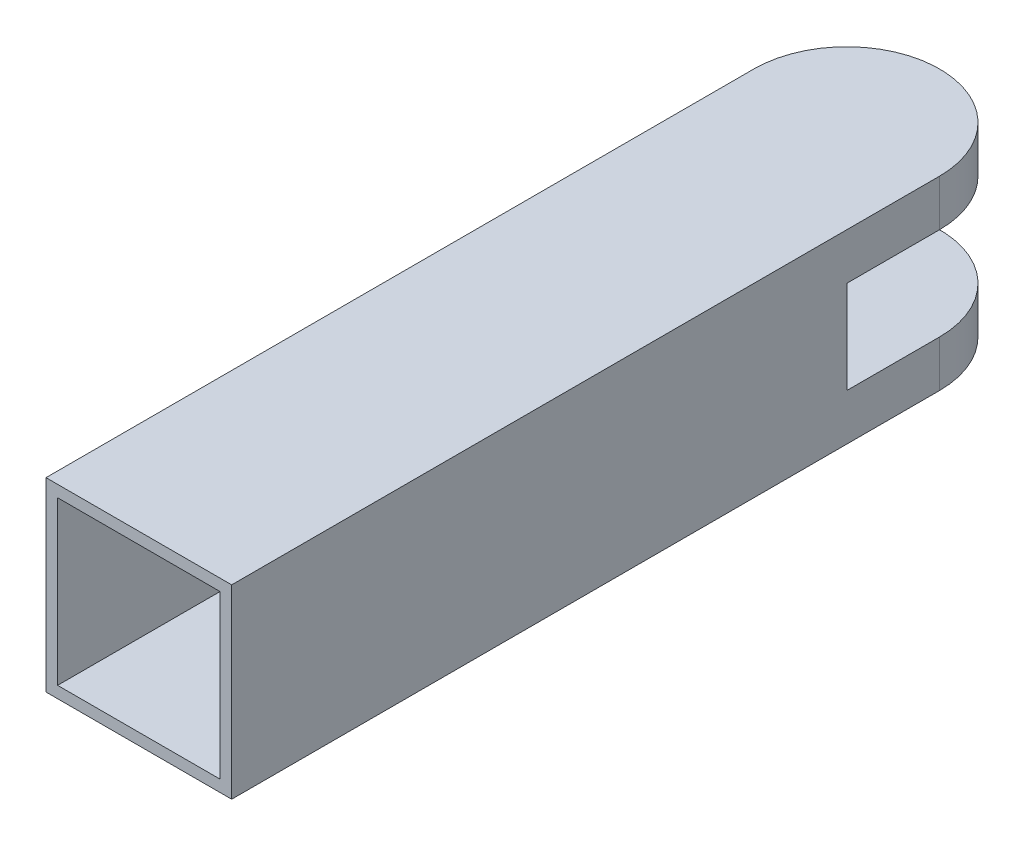
ISO-10303-21;
HEADER;
FILE_DESCRIPTION(('STEP AP214'),'2;1');
FILE_NAME('part.step','',(''),(''),'','','');
FILE_SCHEMA(('AUTOMOTIVE_DESIGN { 1 0 10303 214 1 1 1 1 }'));
ENDSEC;
DATA;
#1=APPLICATION_CONTEXT('core data for automotive mechanical design processes');
#2=APPLICATION_PROTOCOL_DEFINITION('international standard','automotive_design',2000,#1);
#3=PRODUCT_CONTEXT('',#1,'mechanical');
#4=PRODUCT('Part','Part','',(#3));
#5=PRODUCT_RELATED_PRODUCT_CATEGORY('part','',(#4));
#6=PRODUCT_DEFINITION_FORMATION('','',#4);
#7=PRODUCT_DEFINITION_CONTEXT('part definition',#1,'design');
#8=PRODUCT_DEFINITION('design','',#6,#7);
#9=PRODUCT_DEFINITION_SHAPE('','',#8);
#10=(LENGTH_UNIT() NAMED_UNIT(*) SI_UNIT(.MILLI.,.METRE.));
#11=(NAMED_UNIT(*) PLANE_ANGLE_UNIT() SI_UNIT($,.RADIAN.));
#12=(NAMED_UNIT(*) SI_UNIT($,.STERADIAN.) SOLID_ANGLE_UNIT());
#13=UNCERTAINTY_MEASURE_WITH_UNIT(LENGTH_MEASURE(1.E-05),#10,'distance_accuracy_value','');
#14=(GEOMETRIC_REPRESENTATION_CONTEXT(3) GLOBAL_UNCERTAINTY_ASSIGNED_CONTEXT((#13)) GLOBAL_UNIT_ASSIGNED_CONTEXT((#10,
#11,#12)) REPRESENTATION_CONTEXT('',''));
#15=CARTESIAN_POINT('',(0.,0.,0.));
#16=DIRECTION('',(0.,0.,1.));
#17=DIRECTION('',(1.,0.,0.));
#18=AXIS2_PLACEMENT_3D('',#15,#16,#17);
#19=CARTESIAN_POINT('',(0.,8.,-9.));
#20=DIRECTION('',(0.,-1.,0.));
#21=DIRECTION('',(0.,0.,-1.));
#22=AXIS2_PLACEMENT_3D('',#19,#20,#21);
#23=CYLINDRICAL_SURFACE('',#22,8.);
#24=DIRECTION('',(0.,-1.,0.));
#25=VECTOR('',#24,1.);
#26=CARTESIAN_POINT('',(-8.,8.,-9.));
#27=LINE('',#26,#25);
#28=CARTESIAN_POINT('',(-8.,-4.00000000000001,-9.));
#29=VERTEX_POINT('',#28);
#30=CARTESIAN_POINT('',(-8.,-8.,-9.));
#31=VERTEX_POINT('',#30);
#32=EDGE_CURVE('E170',#29,#31,#27,.T.);
#33=ORIENTED_EDGE('',*,*,#32,.F.);
#34=CARTESIAN_POINT('',(0.,-4.,-9.));
#35=DIRECTION('',(0.,-1.,0.));
#36=DIRECTION('',(1.,0.,0.));
#37=AXIS2_PLACEMENT_3D('',#34,#35,#36);
#38=CIRCLE('',#37,8.);
#39=CARTESIAN_POINT('',(8.,-4.,-9.));
#40=VERTEX_POINT('',#39);
#41=EDGE_CURVE('E11',#29,#40,#38,.T.);
#42=ORIENTED_EDGE('',*,*,#41,.T.);
#43=DIRECTION('',(0.,-1.,0.));
#44=VECTOR('',#43,1.);
#45=CARTESIAN_POINT('',(8.,8.,-9.));
#46=LINE('',#45,#44);
#47=CARTESIAN_POINT('',(8.,-8.,-9.));
#48=VERTEX_POINT('',#47);
#49=EDGE_CURVE('E179',#40,#48,#46,.T.);
#50=ORIENTED_EDGE('',*,*,#49,.T.);
#51=CARTESIAN_POINT('',(0.,-8.,-9.));
#52=DIRECTION('',(0.,1.,0.));
#53=DIRECTION('',(0.,0.,-1.));
#54=AXIS2_PLACEMENT_3D('',#51,#52,#53);
#55=CIRCLE('',#54,8.);
#56=EDGE_CURVE('E164',#48,#31,#55,.T.);
#57=ORIENTED_EDGE('',*,*,#56,.T.);
#58=EDGE_LOOP('',(#33,#42,#50,#57));
#59=FACE_BOUND('',#58,.T.);
#60=ADVANCED_FACE('F39',(#59),#23,.T.);
#61=CARTESIAN_POINT('',(-8.,8.,52.));
#62=DIRECTION('',(1.,0.,0.));
#63=DIRECTION('',(0.,1.,0.));
#64=AXIS2_PLACEMENT_3D('',#61,#62,#63);
#65=PLANE('',#64);
#66=DIRECTION('',(0.,-1.,0.));
#67=VECTOR('',#66,1.);
#68=CARTESIAN_POINT('',(-8.00000000000001,3.99999999999999,-1.));
#69=LINE('',#68,#67);
#70=CARTESIAN_POINT('',(-8.00000000000001,3.99999999999999,-1.));
#71=VERTEX_POINT('',#70);
#72=CARTESIAN_POINT('',(-8.,-4.00000000000001,-1.));
#73=VERTEX_POINT('',#72);
#74=EDGE_CURVE('E140',#71,#73,#69,.T.);
#75=ORIENTED_EDGE('',*,*,#74,.T.);
#76=DIRECTION('',(0.,0.,-1.));
#77=VECTOR('',#76,1.);
#78=CARTESIAN_POINT('',(-8.,-4.,-17.));
#79=LINE('',#78,#77);
#80=EDGE_CURVE('E137',#73,#29,#79,.T.);
#81=ORIENTED_EDGE('',*,*,#80,.T.);
#82=ORIENTED_EDGE('',*,*,#32,.T.);
#83=DIRECTION('',(0.,0.,-1.));
#84=VECTOR('',#83,1.);
#85=CARTESIAN_POINT('',(-7.99999999999999,-8.,52.));
#86=LINE('',#85,#84);
#87=CARTESIAN_POINT('',(-7.99999999999999,-8.,52.));
#88=VERTEX_POINT('',#87);
#89=EDGE_CURVE('E245',#88,#31,#86,.T.);
#90=ORIENTED_EDGE('',*,*,#89,.F.);
#91=DIRECTION('',(0.,-1.,0.));
#92=VECTOR('',#91,1.);
#93=CARTESIAN_POINT('',(-8.,8.,52.));
#94=LINE('',#93,#92);
#95=CARTESIAN_POINT('',(-8.,8.,52.));
#96=VERTEX_POINT('',#95);
#97=EDGE_CURVE('E221',#96,#88,#94,.T.);
#98=ORIENTED_EDGE('',*,*,#97,.F.);
#99=DIRECTION('',(0.,0.,-1.));
#100=VECTOR('',#99,1.);
#101=CARTESIAN_POINT('',(-8.,8.,52.));
#102=LINE('',#101,#100);
#103=CARTESIAN_POINT('',(-8.,8.,-9.));
#104=VERTEX_POINT('',#103);
#105=EDGE_CURVE('E234',#96,#104,#102,.T.);
#106=ORIENTED_EDGE('',*,*,#105,.T.);
#107=CARTESIAN_POINT('',(-8.,4.,-9.));
#108=VERTEX_POINT('',#107);
#109=EDGE_CURVE('E149',#104,#108,#27,.T.);
#110=ORIENTED_EDGE('',*,*,#109,.T.);
#111=DIRECTION('',(0.,0.,1.));
#112=VECTOR('',#111,1.);
#113=CARTESIAN_POINT('',(-8.00000000000001,4.,-17.));
#114=LINE('',#113,#112);
#115=EDGE_CURVE('E55',#108,#71,#114,.T.);
#116=ORIENTED_EDGE('',*,*,#115,.T.);
#117=EDGE_LOOP('',(#75,#81,#82,#90,#98,#106,#110,#116));
#118=FACE_BOUND('',#117,.T.);
#119=ADVANCED_FACE('F41',(#118),#65,.F.);
#120=CARTESIAN_POINT('',(0.,0.,52.));
#121=DIRECTION('',(0.,0.,1.));
#122=DIRECTION('',(1.,0.,0.));
#123=AXIS2_PLACEMENT_3D('',#120,#121,#122);
#124=PLANE('',#123);
#125=ORIENTED_EDGE('',*,*,#97,.T.);
#126=DIRECTION('',(1.,0.,0.));
#127=VECTOR('',#126,1.);
#128=CARTESIAN_POINT('',(-7.99999999999999,-8.,52.));
#129=LINE('',#128,#127);
#130=CARTESIAN_POINT('',(8.00000000000001,-8.,52.));
#131=VERTEX_POINT('',#130);
#132=EDGE_CURVE('E225',#88,#131,#129,.T.);
#133=ORIENTED_EDGE('',*,*,#132,.T.);
#134=DIRECTION('',(0.,1.,0.));
#135=VECTOR('',#134,1.);
#136=CARTESIAN_POINT('',(8.,8.,52.));
#137=LINE('',#136,#135);
#138=CARTESIAN_POINT('',(8.,8.,52.));
#139=VERTEX_POINT('',#138);
#140=EDGE_CURVE('E228',#131,#139,#137,.T.);
#141=ORIENTED_EDGE('',*,*,#140,.T.);
#142=DIRECTION('',(-1.,0.,0.));
#143=VECTOR('',#142,1.);
#144=CARTESIAN_POINT('',(-8.,8.,52.));
#145=LINE('',#144,#143);
#146=EDGE_CURVE('E231',#139,#96,#145,.T.);
#147=ORIENTED_EDGE('',*,*,#146,.T.);
#148=EDGE_LOOP('',(#125,#133,#141,#147));
#149=FACE_BOUND('',#148,.T.);
#150=DIRECTION('',(1.,0.,0.));
#151=VECTOR('',#150,1.);
#152=CARTESIAN_POINT('',(-7.,-7.,52.));
#153=LINE('',#152,#151);
#154=CARTESIAN_POINT('',(-7.,-7.,52.));
#155=VERTEX_POINT('',#154);
#156=CARTESIAN_POINT('',(7.,-7.,52.));
#157=VERTEX_POINT('',#156);
#158=EDGE_CURVE('E185',#155,#157,#153,.T.);
#159=ORIENTED_EDGE('',*,*,#158,.F.);
#160=DIRECTION('',(0.,-1.,0.));
#161=VECTOR('',#160,1.);
#162=CARTESIAN_POINT('',(-7.,7.,52.));
#163=LINE('',#162,#161);
#164=CARTESIAN_POINT('',(-7.,7.,52.));
#165=VERTEX_POINT('',#164);
#166=EDGE_CURVE('E182',#165,#155,#163,.T.);
#167=ORIENTED_EDGE('',*,*,#166,.F.);
#168=DIRECTION('',(-1.,0.,0.));
#169=VECTOR('',#168,1.);
#170=CARTESIAN_POINT('',(-7.,7.,52.));
#171=LINE('',#170,#169);
#172=CARTESIAN_POINT('',(7.,7.,52.));
#173=VERTEX_POINT('',#172);
#174=EDGE_CURVE('E192',#173,#165,#171,.T.);
#175=ORIENTED_EDGE('',*,*,#174,.F.);
#176=DIRECTION('',(0.,1.,0.));
#177=VECTOR('',#176,1.);
#178=CARTESIAN_POINT('',(7.,7.,52.));
#179=LINE('',#178,#177);
#180=EDGE_CURVE('E189',#157,#173,#179,.T.);
#181=ORIENTED_EDGE('',*,*,#180,.F.);
#182=EDGE_LOOP('',(#159,#167,#175,#181));
#183=FACE_BOUND('',#182,.T.);
#184=ADVANCED_FACE('F271',(#149,#183),#124,.T.);
#185=CARTESIAN_POINT('',(-7.99999999999999,-8.,52.));
#186=DIRECTION('',(0.,1.,0.));
#187=DIRECTION('',(0.,0.,1.));
#188=AXIS2_PLACEMENT_3D('',#185,#186,#187);
#189=PLANE('',#188);
#190=ORIENTED_EDGE('',*,*,#89,.T.);
#191=ORIENTED_EDGE('',*,*,#56,.F.);
#192=DIRECTION('',(0.,0.,-1.));
#193=VECTOR('',#192,1.);
#194=CARTESIAN_POINT('',(8.00000000000001,-8.,52.));
#195=LINE('',#194,#193);
#196=EDGE_CURVE('E241',#131,#48,#195,.T.);
#197=ORIENTED_EDGE('',*,*,#196,.F.);
#198=ORIENTED_EDGE('',*,*,#132,.F.);
#199=EDGE_LOOP('',(#190,#191,#197,#198));
#200=FACE_BOUND('',#199,.T.);
#201=ADVANCED_FACE('F267',(#200),#189,.F.);
#202=CARTESIAN_POINT('',(8.,8.,52.));
#203=DIRECTION('',(-1.,0.,0.));
#204=DIRECTION('',(0.,-1.,0.));
#205=AXIS2_PLACEMENT_3D('',#202,#203,#204);
#206=PLANE('',#205);
#207=ORIENTED_EDGE('',*,*,#49,.F.);
#208=DIRECTION('',(0.,0.,-1.));
#209=VECTOR('',#208,1.);
#210=CARTESIAN_POINT('',(8.,-4.,-17.));
#211=LINE('',#210,#209);
#212=CARTESIAN_POINT('',(8.,-4.,-1.));
#213=VERTEX_POINT('',#212);
#214=EDGE_CURVE('E151',#213,#40,#211,.T.);
#215=ORIENTED_EDGE('',*,*,#214,.F.);
#216=DIRECTION('',(0.,-1.,0.));
#217=VECTOR('',#216,1.);
#218=CARTESIAN_POINT('',(8.,4.,-1.));
#219=LINE('',#218,#217);
#220=CARTESIAN_POINT('',(8.,4.,-1.));
#221=VERTEX_POINT('',#220);
#222=EDGE_CURVE('E154',#221,#213,#219,.T.);
#223=ORIENTED_EDGE('',*,*,#222,.F.);
#224=DIRECTION('',(0.,0.,1.));
#225=VECTOR('',#224,1.);
#226=CARTESIAN_POINT('',(8.,4.,-17.));
#227=LINE('',#226,#225);
#228=CARTESIAN_POINT('',(8.,4.,-9.));
#229=VERTEX_POINT('',#228);
#230=EDGE_CURVE('E131',#229,#221,#227,.T.);
#231=ORIENTED_EDGE('',*,*,#230,.F.);
#232=CARTESIAN_POINT('',(8.,8.,-9.));
#233=VERTEX_POINT('',#232);
#234=EDGE_CURVE('E174',#233,#229,#46,.T.);
#235=ORIENTED_EDGE('',*,*,#234,.F.);
#236=DIRECTION('',(0.,0.,-1.));
#237=VECTOR('',#236,1.);
#238=CARTESIAN_POINT('',(8.,8.,52.));
#239=LINE('',#238,#237);
#240=EDGE_CURVE('E237',#139,#233,#239,.T.);
#241=ORIENTED_EDGE('',*,*,#240,.F.);
#242=ORIENTED_EDGE('',*,*,#140,.F.);
#243=ORIENTED_EDGE('',*,*,#196,.T.);
#244=EDGE_LOOP('',(#207,#215,#223,#231,#235,#241,#242,#243));
#245=FACE_BOUND('',#244,.T.);
#246=ADVANCED_FACE('F254',(#245),#206,.F.);
#247=CARTESIAN_POINT('',(-8.,8.,52.));
#248=DIRECTION('',(0.,-1.,0.));
#249=DIRECTION('',(0.,0.,-1.));
#250=AXIS2_PLACEMENT_3D('',#247,#248,#249);
#251=PLANE('',#250);
#252=ORIENTED_EDGE('',*,*,#240,.T.);
#253=CARTESIAN_POINT('',(0.,8.,-9.));
#254=DIRECTION('',(0.,1.,0.));
#255=DIRECTION('',(0.,0.,-1.));
#256=AXIS2_PLACEMENT_3D('',#253,#254,#255);
#257=CIRCLE('',#256,8.);
#258=EDGE_CURVE('E166',#233,#104,#257,.T.);
#259=ORIENTED_EDGE('',*,*,#258,.T.);
#260=ORIENTED_EDGE('',*,*,#105,.F.);
#261=ORIENTED_EDGE('',*,*,#146,.F.);
#262=EDGE_LOOP('',(#252,#259,#260,#261));
#263=FACE_BOUND('',#262,.T.);
#264=ADVANCED_FACE('F276',(#263),#251,.F.);
#265=CARTESIAN_POINT('',(-7.,7.,52.));
#266=DIRECTION('',(1.,0.,0.));
#267=DIRECTION('',(0.,1.,0.));
#268=AXIS2_PLACEMENT_3D('',#265,#266,#267);
#269=PLANE('',#268);
#270=DIRECTION('',(0.,-1.,0.));
#271=VECTOR('',#270,1.);
#272=CARTESIAN_POINT('',(-7.,7.,0.));
#273=LINE('',#272,#271);
#274=CARTESIAN_POINT('',(-7.,7.,0.));
#275=VERTEX_POINT('',#274);
#276=CARTESIAN_POINT('',(-7.,-7.,0.));
#277=VERTEX_POINT('',#276);
#278=EDGE_CURVE('E178',#275,#277,#273,.T.);
#279=ORIENTED_EDGE('',*,*,#278,.F.);
#280=DIRECTION('',(0.,0.,-1.));
#281=VECTOR('',#280,1.);
#282=CARTESIAN_POINT('',(-7.,7.,52.));
#283=LINE('',#282,#281);
#284=EDGE_CURVE('E195',#165,#275,#283,.T.);
#285=ORIENTED_EDGE('',*,*,#284,.F.);
#286=ORIENTED_EDGE('',*,*,#166,.T.);
#287=DIRECTION('',(0.,0.,-1.));
#288=VECTOR('',#287,1.);
#289=CARTESIAN_POINT('',(-7.,-7.,52.));
#290=LINE('',#289,#288);
#291=EDGE_CURVE('E217',#155,#277,#290,.T.);
#292=ORIENTED_EDGE('',*,*,#291,.T.);
#293=EDGE_LOOP('',(#279,#285,#286,#292));
#294=FACE_BOUND('',#293,.T.);
#295=ADVANCED_FACE('F278',(#294),#269,.T.);
#296=CARTESIAN_POINT('',(-7.,-7.,52.));
#297=DIRECTION('',(0.,1.,0.));
#298=DIRECTION('',(0.,0.,1.));
#299=AXIS2_PLACEMENT_3D('',#296,#297,#298);
#300=PLANE('',#299);
#301=DIRECTION('',(1.,0.,0.));
#302=VECTOR('',#301,1.);
#303=CARTESIAN_POINT('',(-7.,-7.,0.));
#304=LINE('',#303,#302);
#305=CARTESIAN_POINT('',(7.,-7.,0.));
#306=VERTEX_POINT('',#305);
#307=EDGE_CURVE('E199',#277,#306,#304,.T.);
#308=ORIENTED_EDGE('',*,*,#307,.F.);
#309=ORIENTED_EDGE('',*,*,#291,.F.);
#310=ORIENTED_EDGE('',*,*,#158,.T.);
#311=DIRECTION('',(0.,0.,-1.));
#312=VECTOR('',#311,1.);
#313=CARTESIAN_POINT('',(7.,-7.,52.));
#314=LINE('',#313,#312);
#315=EDGE_CURVE('E214',#157,#306,#314,.T.);
#316=ORIENTED_EDGE('',*,*,#315,.T.);
#317=EDGE_LOOP('',(#308,#309,#310,#316));
#318=FACE_BOUND('',#317,.T.);
#319=ADVANCED_FACE('F284',(#318),#300,.T.);
#320=CARTESIAN_POINT('',(7.,7.,52.));
#321=DIRECTION('',(-1.,0.,0.));
#322=DIRECTION('',(0.,-1.,0.));
#323=AXIS2_PLACEMENT_3D('',#320,#321,#322);
#324=PLANE('',#323);
#325=DIRECTION('',(0.,1.,0.));
#326=VECTOR('',#325,1.);
#327=CARTESIAN_POINT('',(7.,7.,0.));
#328=LINE('',#327,#326);
#329=CARTESIAN_POINT('',(7.,7.,0.));
#330=VERTEX_POINT('',#329);
#331=EDGE_CURVE('E203',#306,#330,#328,.T.);
#332=ORIENTED_EDGE('',*,*,#331,.F.);
#333=ORIENTED_EDGE('',*,*,#315,.F.);
#334=ORIENTED_EDGE('',*,*,#180,.T.);
#335=DIRECTION('',(0.,0.,-1.));
#336=VECTOR('',#335,1.);
#337=CARTESIAN_POINT('',(7.,7.,52.));
#338=LINE('',#337,#336);
#339=EDGE_CURVE('E63',#173,#330,#338,.T.);
#340=ORIENTED_EDGE('',*,*,#339,.T.);
#341=EDGE_LOOP('',(#332,#333,#334,#340));
#342=FACE_BOUND('',#341,.T.);
#343=ADVANCED_FACE('F308',(#342),#324,.T.);
#344=CARTESIAN_POINT('',(-7.,7.,52.));
#345=DIRECTION('',(0.,-1.,0.));
#346=DIRECTION('',(0.,0.,-1.));
#347=AXIS2_PLACEMENT_3D('',#344,#345,#346);
#348=PLANE('',#347);
#349=DIRECTION('',(-1.,0.,0.));
#350=VECTOR('',#349,1.);
#351=CARTESIAN_POINT('',(-7.,7.,0.));
#352=LINE('',#351,#350);
#353=EDGE_CURVE('E186',#330,#275,#352,.T.);
#354=ORIENTED_EDGE('',*,*,#353,.F.);
#355=ORIENTED_EDGE('',*,*,#339,.F.);
#356=ORIENTED_EDGE('',*,*,#174,.T.);
#357=ORIENTED_EDGE('',*,*,#284,.T.);
#358=EDGE_LOOP('',(#354,#355,#356,#357));
#359=FACE_BOUND('',#358,.T.);
#360=ADVANCED_FACE('F303',(#359),#348,.T.);
#361=CARTESIAN_POINT('',(0.,0.,0.));
#362=DIRECTION('',(0.,0.,-1.));
#363=DIRECTION('',(-1.,0.,0.));
#364=AXIS2_PLACEMENT_3D('',#361,#362,#363);
#365=PLANE('',#364);
#366=ORIENTED_EDGE('',*,*,#353,.T.);
#367=ORIENTED_EDGE('',*,*,#278,.T.);
#368=ORIENTED_EDGE('',*,*,#307,.T.);
#369=ORIENTED_EDGE('',*,*,#331,.T.);
#370=EDGE_LOOP('',(#366,#367,#368,#369));
#371=FACE_BOUND('',#370,.T.);
#372=ADVANCED_FACE('F297',(#371),#365,.F.);
#373=ORIENTED_EDGE('',*,*,#234,.T.);
#374=CARTESIAN_POINT('',(0.,4.,-9.));
#375=DIRECTION('',(0.,1.,0.));
#376=DIRECTION('',(-1.,0.,0.));
#377=AXIS2_PLACEMENT_3D('',#374,#375,#376);
#378=CIRCLE('',#377,8.);
#379=EDGE_CURVE('E48',#229,#108,#378,.T.);
#380=ORIENTED_EDGE('',*,*,#379,.T.);
#381=ORIENTED_EDGE('',*,*,#109,.F.);
#382=ORIENTED_EDGE('',*,*,#258,.F.);
#383=EDGE_LOOP('',(#373,#380,#381,#382));
#384=FACE_BOUND('',#383,.T.);
#385=ADVANCED_FACE('F250',(#384),#23,.T.);
#386=CARTESIAN_POINT('',(-8.,-4.,-17.));
#387=DIRECTION('',(0.,-1.,0.));
#388=DIRECTION('',(1.,0.,0.));
#389=AXIS2_PLACEMENT_3D('',#386,#387,#388);
#390=PLANE('',#389);
#391=ORIENTED_EDGE('',*,*,#80,.F.);
#392=DIRECTION('',(1.,0.,0.));
#393=VECTOR('',#392,1.);
#394=CARTESIAN_POINT('',(-8.,-4.00000000000001,-1.));
#395=LINE('',#394,#393);
#396=EDGE_CURVE('E136',#73,#213,#395,.T.);
#397=ORIENTED_EDGE('',*,*,#396,.T.);
#398=ORIENTED_EDGE('',*,*,#214,.T.);
#399=ORIENTED_EDGE('',*,*,#41,.F.);
#400=EDGE_LOOP('',(#391,#397,#398,#399));
#401=FACE_BOUND('',#400,.T.);
#402=ADVANCED_FACE('F258',(#401),#390,.F.);
#403=CARTESIAN_POINT('',(-8.00000000000001,4.,-17.));
#404=DIRECTION('',(0.,1.,0.));
#405=DIRECTION('',(-1.,0.,0.));
#406=AXIS2_PLACEMENT_3D('',#403,#404,#405);
#407=PLANE('',#406);
#408=ORIENTED_EDGE('',*,*,#230,.T.);
#409=DIRECTION('',(1.,0.,0.));
#410=VECTOR('',#409,1.);
#411=CARTESIAN_POINT('',(-8.00000000000001,3.99999999999999,-1.));
#412=LINE('',#411,#410);
#413=EDGE_CURVE('E127',#71,#221,#412,.T.);
#414=ORIENTED_EDGE('',*,*,#413,.F.);
#415=ORIENTED_EDGE('',*,*,#115,.F.);
#416=ORIENTED_EDGE('',*,*,#379,.F.);
#417=EDGE_LOOP('',(#408,#414,#415,#416));
#418=FACE_BOUND('',#417,.T.);
#419=ADVANCED_FACE('F129',(#418),#407,.F.);
#420=CARTESIAN_POINT('',(-8.00000000000001,3.99999999999999,-1.));
#421=DIRECTION('',(0.,0.,1.));
#422=DIRECTION('',(1.,0.,0.));
#423=AXIS2_PLACEMENT_3D('',#420,#421,#422);
#424=PLANE('',#423);
#425=ORIENTED_EDGE('',*,*,#222,.T.);
#426=ORIENTED_EDGE('',*,*,#396,.F.);
#427=ORIENTED_EDGE('',*,*,#74,.F.);
#428=ORIENTED_EDGE('',*,*,#413,.T.);
#429=EDGE_LOOP('',(#425,#426,#427,#428));
#430=FACE_BOUND('',#429,.T.);
#431=ADVANCED_FACE('F141',(#430),#424,.F.);
#432=CLOSED_SHELL('',(#60,#119,#184,#201,#246,#264,#295,#319,#343,#360,#372,#385,#402,#419,#431));
#433=MANIFOLD_SOLID_BREP('B2',#432);
#434=ADVANCED_BREP_SHAPE_REPRESENTATION('',(#18,#433),#14);
#435=SHAPE_DEFINITION_REPRESENTATION(#9,#434);
ENDSEC;
END-ISO-10303-21;
